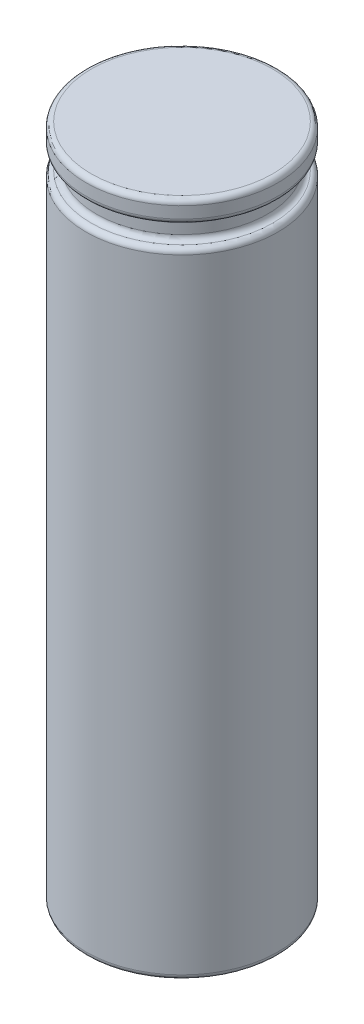
ISO-10303-21;
HEADER;
FILE_DESCRIPTION(('STEP AP214'),'2;1');
FILE_NAME('part.step','',(''),(''),'','','');
FILE_SCHEMA(('AUTOMOTIVE_DESIGN { 1 0 10303 214 1 1 1 1 }'));
ENDSEC;
DATA;
#1=APPLICATION_CONTEXT('core data for automotive mechanical design processes');
#2=APPLICATION_PROTOCOL_DEFINITION('international standard','automotive_design',2000,#1);
#3=PRODUCT_CONTEXT('',#1,'mechanical');
#4=PRODUCT('Part','Part','',(#3));
#5=PRODUCT_RELATED_PRODUCT_CATEGORY('part','',(#4));
#6=PRODUCT_DEFINITION_FORMATION('','',#4);
#7=PRODUCT_DEFINITION_CONTEXT('part definition',#1,'design');
#8=PRODUCT_DEFINITION('design','',#6,#7);
#9=PRODUCT_DEFINITION_SHAPE('','',#8);
#10=(LENGTH_UNIT() NAMED_UNIT(*) SI_UNIT(.MILLI.,.METRE.));
#11=(NAMED_UNIT(*) PLANE_ANGLE_UNIT() SI_UNIT($,.RADIAN.));
#12=(NAMED_UNIT(*) SI_UNIT($,.STERADIAN.) SOLID_ANGLE_UNIT());
#13=UNCERTAINTY_MEASURE_WITH_UNIT(LENGTH_MEASURE(1.E-05),#10,'distance_accuracy_value','');
#14=(GEOMETRIC_REPRESENTATION_CONTEXT(3) GLOBAL_UNCERTAINTY_ASSIGNED_CONTEXT((#13)) GLOBAL_UNIT_ASSIGNED_CONTEXT((#10,
#11,#12)) REPRESENTATION_CONTEXT('',''));
#15=CARTESIAN_POINT('',(0.,0.,0.));
#16=DIRECTION('',(0.,0.,1.));
#17=DIRECTION('',(1.,0.,0.));
#18=AXIS2_PLACEMENT_3D('',#15,#16,#17);
#19=CARTESIAN_POINT('',(0.,65.2,0.));
#20=DIRECTION('',(0.,-1.,0.));
#21=DIRECTION('',(0.,0.,-1.));
#22=AXIS2_PLACEMENT_3D('',#19,#20,#21);
#23=CYLINDRICAL_SURFACE('',#22,9.25);
#24=CARTESIAN_POINT('',(0.,0.5,0.));
#25=DIRECTION('',(0.,1.,0.));
#26=DIRECTION('',(0.,0.,1.));
#27=AXIS2_PLACEMENT_3D('',#24,#25,#26);
#28=CIRCLE('',#27,9.25);
#29=CARTESIAN_POINT('',(0.,0.5,9.25));
#30=VERTEX_POINT('',#29);
#31=EDGE_CURVE('E52',#30,#30,#28,.T.);
#32=ORIENTED_EDGE('',*,*,#31,.T.);
#33=EDGE_LOOP('',(#32));
#34=FACE_BOUND('',#33,.T.);
#35=CARTESIAN_POINT('',(0.,60.5869140084276,0.));
#36=DIRECTION('',(0.,1.,0.));
#37=DIRECTION('',(0.,0.,1.));
#38=AXIS2_PLACEMENT_3D('',#35,#36,#37);
#39=CIRCLE('',#38,9.25);
#40=CARTESIAN_POINT('',(0.,60.5869140084276,9.25));
#41=VERTEX_POINT('',#40);
#42=EDGE_CURVE('E48',#41,#41,#39,.F.);
#43=ORIENTED_EDGE('',*,*,#42,.T.);
#44=EDGE_LOOP('',(#43));
#45=FACE_BOUND('',#44,.T.);
#46=ADVANCED_FACE('F30',(#34,#45),#23,.T.);
#47=CARTESIAN_POINT('',(0.,0.,0.));
#48=DIRECTION('',(0.,1.,0.));
#49=DIRECTION('',(0.,0.,1.));
#50=AXIS2_PLACEMENT_3D('',#47,#48,#49);
#51=PLANE('',#50);
#52=CARTESIAN_POINT('',(0.,0.,0.));
#53=DIRECTION('',(0.,1.,0.));
#54=DIRECTION('',(0.,0.,1.));
#55=AXIS2_PLACEMENT_3D('',#52,#53,#54);
#56=CIRCLE('',#55,8.75);
#57=CARTESIAN_POINT('',(0.,0.,8.75));
#58=VERTEX_POINT('',#57);
#59=EDGE_CURVE('E106',#58,#58,#56,.F.);
#60=ORIENTED_EDGE('',*,*,#59,.T.);
#61=EDGE_LOOP('',(#60));
#62=FACE_BOUND('',#61,.T.);
#63=ADVANCED_FACE('F71',(#62),#51,.F.);
#64=CARTESIAN_POINT('',(0.,65.2,0.));
#65=DIRECTION('',(0.,1.,0.));
#66=DIRECTION('',(0.,0.,1.));
#67=AXIS2_PLACEMENT_3D('',#64,#65,#66);
#68=CYLINDRICAL_SURFACE('',#67,8.25);
#69=CARTESIAN_POINT('',(0.,62.5869140084276,0.));
#70=DIRECTION('',(0.,-1.,0.));
#71=DIRECTION('',(0.,0.,-1.));
#72=AXIS2_PLACEMENT_3D('',#69,#70,#71);
#73=CIRCLE('',#72,8.25);
#74=CARTESIAN_POINT('',(0.,62.5869140084276,-8.25));
#75=VERTEX_POINT('',#74);
#76=EDGE_CURVE('E10',#75,#75,#73,.T.);
#77=ORIENTED_EDGE('',*,*,#76,.T.);
#78=EDGE_LOOP('',(#77));
#79=FACE_BOUND('',#78,.T.);
#80=CARTESIAN_POINT('',(0.,61.5869140084276,0.));
#81=DIRECTION('',(0.,1.,0.));
#82=DIRECTION('',(0.,0.,1.));
#83=AXIS2_PLACEMENT_3D('',#80,#81,#82);
#84=CIRCLE('',#83,8.25);
#85=CARTESIAN_POINT('',(0.,61.5869140084276,8.25));
#86=VERTEX_POINT('',#85);
#87=EDGE_CURVE('E38',#86,#86,#84,.T.);
#88=ORIENTED_EDGE('',*,*,#87,.T.);
#89=EDGE_LOOP('',(#88));
#90=FACE_BOUND('',#89,.T.);
#91=ADVANCED_FACE('F78',(#79,#90),#68,.T.);
#92=CARTESIAN_POINT('',(0.,65.2,0.));
#93=DIRECTION('',(0.,1.,0.));
#94=DIRECTION('',(0.,0.,1.));
#95=AXIS2_PLACEMENT_3D('',#92,#93,#94);
#96=PLANE('',#95);
#97=CARTESIAN_POINT('',(0.,65.2,0.));
#98=DIRECTION('',(0.,1.,0.));
#99=DIRECTION('',(0.,0.,1.));
#100=AXIS2_PLACEMENT_3D('',#97,#98,#99);
#101=CIRCLE('',#100,8.75);
#102=CARTESIAN_POINT('',(0.,65.2,8.75));
#103=VERTEX_POINT('',#102);
#104=EDGE_CURVE('E103',#103,#103,#101,.T.);
#105=ORIENTED_EDGE('',*,*,#104,.T.);
#106=EDGE_LOOP('',(#105));
#107=FACE_BOUND('',#106,.T.);
#108=ADVANCED_FACE('F86',(#107),#96,.T.);
#109=CARTESIAN_POINT('',(0.,64.7,0.));
#110=DIRECTION('',(0.,1.,0.));
#111=DIRECTION('',(0.,0.,1.));
#112=AXIS2_PLACEMENT_3D('',#109,#110,#111);
#113=CIRCLE('',#112,9.25);
#114=CARTESIAN_POINT('',(0.,64.7,9.25));
#115=VERTEX_POINT('',#114);
#116=EDGE_CURVE('E43',#115,#115,#113,.F.);
#117=ORIENTED_EDGE('',*,*,#116,.T.);
#118=EDGE_LOOP('',(#117));
#119=FACE_BOUND('',#118,.T.);
#120=CARTESIAN_POINT('',(0.,63.5869140084276,0.));
#121=DIRECTION('',(0.,-1.,0.));
#122=DIRECTION('',(0.,0.,-1.));
#123=AXIS2_PLACEMENT_3D('',#120,#121,#122);
#124=CIRCLE('',#123,9.25);
#125=CARTESIAN_POINT('',(0.,63.5869140084276,-9.25));
#126=VERTEX_POINT('',#125);
#127=EDGE_CURVE('E101',#126,#126,#124,.F.);
#128=ORIENTED_EDGE('',*,*,#127,.T.);
#129=EDGE_LOOP('',(#128));
#130=FACE_BOUND('',#129,.T.);
#131=ADVANCED_FACE('F74',(#119,#130),#23,.T.);
#132=CARTESIAN_POINT('',(0.,0.5,0.));
#133=DIRECTION('',(0.,1.,0.));
#134=DIRECTION('',(0.,0.,1.));
#135=AXIS2_PLACEMENT_3D('',#132,#133,#134);
#136=TOROIDAL_SURFACE('',#135,8.75,0.5);
#137=ORIENTED_EDGE('',*,*,#59,.F.);
#138=EDGE_LOOP('',(#137));
#139=FACE_BOUND('',#138,.T.);
#140=ORIENTED_EDGE('',*,*,#31,.F.);
#141=EDGE_LOOP('',(#140));
#142=FACE_BOUND('',#141,.T.);
#143=ADVANCED_FACE('F85',(#139,#142),#136,.T.);
#144=CARTESIAN_POINT('',(0.,64.7,0.));
#145=DIRECTION('',(0.,1.,0.));
#146=DIRECTION('',(0.,0.,1.));
#147=AXIS2_PLACEMENT_3D('',#144,#145,#146);
#148=TOROIDAL_SURFACE('',#147,8.75,0.5);
#149=ORIENTED_EDGE('',*,*,#116,.F.);
#150=EDGE_LOOP('',(#149));
#151=FACE_BOUND('',#150,.T.);
#152=ORIENTED_EDGE('',*,*,#104,.F.);
#153=EDGE_LOOP('',(#152));
#154=FACE_BOUND('',#153,.T.);
#155=ADVANCED_FACE('F92',(#151,#154),#148,.T.);
#156=CARTESIAN_POINT('',(0.,62.5869140084276,0.));
#157=DIRECTION('',(0.,-1.,0.));
#158=DIRECTION('',(0.,0.,-1.));
#159=AXIS2_PLACEMENT_3D('',#156,#157,#158);
#160=TOROIDAL_SURFACE('',#159,8.75,0.5);
#161=ORIENTED_EDGE('',*,*,#76,.F.);
#162=EDGE_LOOP('',(#161));
#163=FACE_BOUND('',#162,.T.);
#164=CARTESIAN_POINT('',(0.,63.0869140084276,0.));
#165=DIRECTION('',(0.,-1.,0.));
#166=DIRECTION('',(0.,0.,-1.));
#167=AXIS2_PLACEMENT_3D('',#164,#165,#166);
#168=CIRCLE('',#167,8.75);
#169=CARTESIAN_POINT('',(0.,63.0869140084276,-8.75));
#170=VERTEX_POINT('',#169);
#171=EDGE_CURVE('E46',#170,#170,#168,.F.);
#172=ORIENTED_EDGE('',*,*,#171,.F.);
#173=EDGE_LOOP('',(#172));
#174=FACE_BOUND('',#173,.T.);
#175=ADVANCED_FACE('F67',(#163,#174),#160,.F.);
#176=CARTESIAN_POINT('',(0.,63.5869140084276,0.));
#177=DIRECTION('',(0.,-1.,0.));
#178=DIRECTION('',(0.,0.,-1.));
#179=AXIS2_PLACEMENT_3D('',#176,#177,#178);
#180=TOROIDAL_SURFACE('',#179,8.75,0.5);
#181=ORIENTED_EDGE('',*,*,#171,.T.);
#182=EDGE_LOOP('',(#181));
#183=FACE_BOUND('',#182,.T.);
#184=ORIENTED_EDGE('',*,*,#127,.F.);
#185=EDGE_LOOP('',(#184));
#186=FACE_BOUND('',#185,.T.);
#187=ADVANCED_FACE('F61',(#183,#186),#180,.T.);
#188=CARTESIAN_POINT('',(0.,60.5869140084276,0.));
#189=DIRECTION('',(0.,1.,0.));
#190=DIRECTION('',(0.,0.,1.));
#191=AXIS2_PLACEMENT_3D('',#188,#189,#190);
#192=TOROIDAL_SURFACE('',#191,8.75,0.5);
#193=ORIENTED_EDGE('',*,*,#42,.F.);
#194=EDGE_LOOP('',(#193));
#195=FACE_BOUND('',#194,.T.);
#196=CARTESIAN_POINT('',(0.,61.0869140084276,0.));
#197=DIRECTION('',(0.,1.,0.));
#198=DIRECTION('',(0.,0.,1.));
#199=AXIS2_PLACEMENT_3D('',#196,#197,#198);
#200=CIRCLE('',#199,8.75);
#201=CARTESIAN_POINT('',(0.,61.0869140084276,8.75));
#202=VERTEX_POINT('',#201);
#203=EDGE_CURVE('E34',#202,#202,#200,.T.);
#204=ORIENTED_EDGE('',*,*,#203,.F.);
#205=EDGE_LOOP('',(#204));
#206=FACE_BOUND('',#205,.T.);
#207=ADVANCED_FACE('F32',(#195,#206),#192,.T.);
#208=CARTESIAN_POINT('',(0.,61.5869140084276,0.));
#209=DIRECTION('',(0.,1.,0.));
#210=DIRECTION('',(0.,0.,1.));
#211=AXIS2_PLACEMENT_3D('',#208,#209,#210);
#212=TOROIDAL_SURFACE('',#211,8.75,0.5);
#213=ORIENTED_EDGE('',*,*,#203,.T.);
#214=EDGE_LOOP('',(#213));
#215=FACE_BOUND('',#214,.T.);
#216=ORIENTED_EDGE('',*,*,#87,.F.);
#217=EDGE_LOOP('',(#216));
#218=FACE_BOUND('',#217,.T.);
#219=ADVANCED_FACE('F57',(#215,#218),#212,.F.);
#220=CLOSED_SHELL('',(#46,#63,#91,#108,#131,#143,#155,#175,#187,#207,#219));
#221=MANIFOLD_SOLID_BREP('B2',#220);
#222=ADVANCED_BREP_SHAPE_REPRESENTATION('',(#18,#221),#14);
#223=SHAPE_DEFINITION_REPRESENTATION(#9,#222);
ENDSEC;
END-ISO-10303-21;
